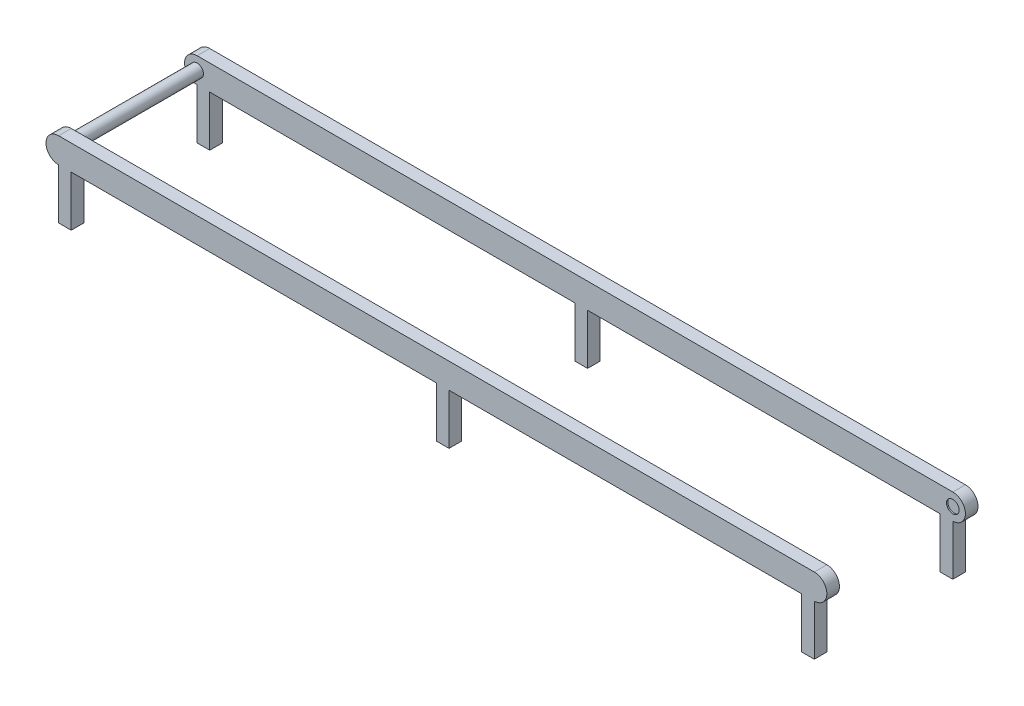
ISO-10303-21;
HEADER;
FILE_DESCRIPTION(('STEP AP214'),'2;1');
FILE_NAME('part.step','',(''),(''),'','','');
FILE_SCHEMA(('AUTOMOTIVE_DESIGN { 1 0 10303 214 1 1 1 1 }'));
ENDSEC;
DATA;
#1=APPLICATION_CONTEXT('core data for automotive mechanical design processes');
#2=APPLICATION_PROTOCOL_DEFINITION('international standard','automotive_design',2000,#1);
#3=PRODUCT_CONTEXT('',#1,'mechanical');
#4=PRODUCT('Part','Part','',(#3));
#5=PRODUCT_RELATED_PRODUCT_CATEGORY('part','',(#4));
#6=PRODUCT_DEFINITION_FORMATION('','',#4);
#7=PRODUCT_DEFINITION_CONTEXT('part definition',#1,'design');
#8=PRODUCT_DEFINITION('design','',#6,#7);
#9=PRODUCT_DEFINITION_SHAPE('','',#8);
#10=(LENGTH_UNIT() NAMED_UNIT(*) SI_UNIT(.MILLI.,.METRE.));
#11=(NAMED_UNIT(*) PLANE_ANGLE_UNIT() SI_UNIT($,.RADIAN.));
#12=(NAMED_UNIT(*) SI_UNIT($,.STERADIAN.) SOLID_ANGLE_UNIT());
#13=UNCERTAINTY_MEASURE_WITH_UNIT(LENGTH_MEASURE(1.E-05),#10,'distance_accuracy_value','');
#14=(GEOMETRIC_REPRESENTATION_CONTEXT(3) GLOBAL_UNCERTAINTY_ASSIGNED_CONTEXT((#13)) GLOBAL_UNIT_ASSIGNED_CONTEXT((#10,
#11,#12)) REPRESENTATION_CONTEXT('',''));
#15=CARTESIAN_POINT('',(0.,0.,0.));
#16=DIRECTION('',(0.,0.,1.));
#17=DIRECTION('',(1.,0.,0.));
#18=AXIS2_PLACEMENT_3D('',#15,#16,#17);
#19=CARTESIAN_POINT('',(-300.,-10.0000000000001,10.));
#20=DIRECTION('',(0.,1.,0.));
#21=DIRECTION('',(0.,0.,1.));
#22=AXIS2_PLACEMENT_3D('',#19,#20,#21);
#23=PLANE('',#22);
#24=DIRECTION('',(0.,0.,1.));
#25=VECTOR('',#24,1.);
#26=CARTESIAN_POINT('',(10.,-10.0000000000001,0.));
#27=LINE('',#26,#25);
#28=CARTESIAN_POINT('',(10.,-10.0000000000001,0.));
#29=VERTEX_POINT('',#28);
#30=CARTESIAN_POINT('',(10.,-10.0000000000001,10.));
#31=VERTEX_POINT('',#30);
#32=EDGE_CURVE('E233',#29,#31,#27,.T.);
#33=ORIENTED_EDGE('',*,*,#32,.F.);
#34=DIRECTION('',(1.,0.,0.));
#35=VECTOR('',#34,1.);
#36=CARTESIAN_POINT('',(-300.,-10.0000000000001,0.));
#37=LINE('',#36,#35);
#38=CARTESIAN_POINT('',(290.,-10.0000000000001,0.));
#39=VERTEX_POINT('',#38);
#40=EDGE_CURVE('E219',#29,#39,#37,.T.);
#41=ORIENTED_EDGE('',*,*,#40,.T.);
#42=DIRECTION('',(0.,0.,1.));
#43=VECTOR('',#42,1.);
#44=CARTESIAN_POINT('',(290.,-10.0000000000001,0.));
#45=LINE('',#44,#43);
#46=CARTESIAN_POINT('',(290.,-10.0000000000001,10.));
#47=VERTEX_POINT('',#46);
#48=EDGE_CURVE('E322',#39,#47,#45,.T.);
#49=ORIENTED_EDGE('',*,*,#48,.T.);
#50=DIRECTION('',(1.,0.,0.));
#51=VECTOR('',#50,1.);
#52=CARTESIAN_POINT('',(-300.,-10.0000000000001,10.));
#53=LINE('',#52,#51);
#54=EDGE_CURVE('E48',#31,#47,#53,.T.);
#55=ORIENTED_EDGE('',*,*,#54,.F.);
#56=EDGE_LOOP('',(#33,#41,#49,#55));
#57=FACE_BOUND('',#56,.T.);
#58=ADVANCED_FACE('F33',(#57),#23,.F.);
#59=CARTESIAN_POINT('',(-300.,-10.0000000000001,120.));
#60=DIRECTION('',(0.,1.,0.));
#61=DIRECTION('',(-1.,0.,0.));
#62=AXIS2_PLACEMENT_3D('',#59,#60,#61);
#63=PLANE('',#62);
#64=DIRECTION('',(0.,0.,1.));
#65=VECTOR('',#64,1.);
#66=CARTESIAN_POINT('',(10.,-10.0000000000001,110.));
#67=LINE('',#66,#65);
#68=CARTESIAN_POINT('',(10.,-10.0000000000001,110.));
#69=VERTEX_POINT('',#68);
#70=CARTESIAN_POINT('',(10.,-10.0000000000001,120.));
#71=VERTEX_POINT('',#70);
#72=EDGE_CURVE('E272',#69,#71,#67,.T.);
#73=ORIENTED_EDGE('',*,*,#72,.F.);
#74=DIRECTION('',(1.,0.,0.));
#75=VECTOR('',#74,1.);
#76=CARTESIAN_POINT('',(-300.,-10.0000000000001,110.));
#77=LINE('',#76,#75);
#78=CARTESIAN_POINT('',(290.,-10.0000000000001,110.));
#79=VERTEX_POINT('',#78);
#80=EDGE_CURVE('E402',#69,#79,#77,.T.);
#81=ORIENTED_EDGE('',*,*,#80,.T.);
#82=DIRECTION('',(0.,0.,1.));
#83=VECTOR('',#82,1.);
#84=CARTESIAN_POINT('',(290.,-10.0000000000001,110.));
#85=LINE('',#84,#83);
#86=CARTESIAN_POINT('',(290.,-10.0000000000001,120.));
#87=VERTEX_POINT('',#86);
#88=EDGE_CURVE('E299',#79,#87,#85,.T.);
#89=ORIENTED_EDGE('',*,*,#88,.T.);
#90=DIRECTION('',(1.,0.,0.));
#91=VECTOR('',#90,1.);
#92=CARTESIAN_POINT('',(-300.,-10.0000000000001,120.));
#93=LINE('',#92,#91);
#94=EDGE_CURVE('E391',#71,#87,#93,.T.);
#95=ORIENTED_EDGE('',*,*,#94,.F.);
#96=EDGE_LOOP('',(#73,#81,#89,#95));
#97=FACE_BOUND('',#96,.T.);
#98=ADVANCED_FACE('F486',(#97),#63,.F.);
#99=CARTESIAN_POINT('',(-290.,-10.0000000000001,110.));
#100=VERTEX_POINT('',#99);
#101=CARTESIAN_POINT('',(0.,-10.0000000000001,110.));
#102=VERTEX_POINT('',#101);
#103=EDGE_CURVE('E387',#100,#102,#77,.T.);
#104=ORIENTED_EDGE('',*,*,#103,.T.);
#105=DIRECTION('',(0.,0.,1.));
#106=VECTOR('',#105,1.);
#107=CARTESIAN_POINT('',(0.,-10.0000000000001,110.));
#108=LINE('',#107,#106);
#109=CARTESIAN_POINT('',(0.,-10.0000000000001,120.));
#110=VERTEX_POINT('',#109);
#111=EDGE_CURVE('E275',#102,#110,#108,.T.);
#112=ORIENTED_EDGE('',*,*,#111,.T.);
#113=CARTESIAN_POINT('',(-290.,-10.0000000000001,120.));
#114=VERTEX_POINT('',#113);
#115=EDGE_CURVE('E392',#114,#110,#93,.T.);
#116=ORIENTED_EDGE('',*,*,#115,.F.);
#117=DIRECTION('',(0.,0.,1.));
#118=VECTOR('',#117,1.);
#119=CARTESIAN_POINT('',(-290.,-10.0000000000001,110.));
#120=LINE('',#119,#118);
#121=EDGE_CURVE('E348',#100,#114,#120,.T.);
#122=ORIENTED_EDGE('',*,*,#121,.F.);
#123=EDGE_LOOP('',(#104,#112,#116,#122));
#124=FACE_BOUND('',#123,.T.);
#125=ADVANCED_FACE('F491',(#124),#63,.F.);
#126=CARTESIAN_POINT('',(-300.,0.,10.));
#127=DIRECTION('',(0.,0.,-1.));
#128=DIRECTION('',(-1.,0.,0.));
#129=AXIS2_PLACEMENT_3D('',#126,#127,#128);
#130=CYLINDRICAL_SURFACE('',#129,10.0000000000001);
#131=CARTESIAN_POINT('',(-300.,0.,0.));
#132=DIRECTION('',(0.,0.,1.));
#133=DIRECTION('',(1.,0.,0.));
#134=AXIS2_PLACEMENT_3D('',#131,#132,#133);
#135=CIRCLE('',#134,10.0000000000001);
#136=CARTESIAN_POINT('',(-300.,10.0000000000001,0.));
#137=VERTEX_POINT('',#136);
#138=CARTESIAN_POINT('',(-300.,-10.0000000000001,0.));
#139=VERTEX_POINT('',#138);
#140=EDGE_CURVE('E230',#137,#139,#135,.T.);
#141=ORIENTED_EDGE('',*,*,#140,.T.);
#142=DIRECTION('',(0.,0.,-1.));
#143=VECTOR('',#142,1.);
#144=CARTESIAN_POINT('',(-300.,-10.0000000000001,10.));
#145=LINE('',#144,#143);
#146=CARTESIAN_POINT('',(-300.,-10.0000000000001,10.));
#147=VERTEX_POINT('',#146);
#148=EDGE_CURVE('E11',#147,#139,#145,.T.);
#149=ORIENTED_EDGE('',*,*,#148,.F.);
#150=CARTESIAN_POINT('',(-300.,0.,10.));
#151=DIRECTION('',(0.,0.,1.));
#152=DIRECTION('',(1.,0.,0.));
#153=AXIS2_PLACEMENT_3D('',#150,#151,#152);
#154=CIRCLE('',#153,10.0000000000001);
#155=CARTESIAN_POINT('',(-300.,10.0000000000001,10.));
#156=VERTEX_POINT('',#155);
#157=EDGE_CURVE('E427',#156,#147,#154,.T.);
#158=ORIENTED_EDGE('',*,*,#157,.F.);
#159=DIRECTION('',(0.,0.,-1.));
#160=VECTOR('',#159,1.);
#161=CARTESIAN_POINT('',(-300.,10.0000000000001,10.));
#162=LINE('',#161,#160);
#163=EDGE_CURVE('E436',#156,#137,#162,.T.);
#164=ORIENTED_EDGE('',*,*,#163,.T.);
#165=EDGE_LOOP('',(#141,#149,#158,#164));
#166=FACE_BOUND('',#165,.T.);
#167=ADVANCED_FACE('F35',(#166),#130,.T.);
#168=CARTESIAN_POINT('',(-290.,-10.0000000000001,0.));
#169=VERTEX_POINT('',#168);
#170=CARTESIAN_POINT('',(0.,-10.0000000000001,0.));
#171=VERTEX_POINT('',#170);
#172=EDGE_CURVE('E229',#169,#171,#37,.T.);
#173=ORIENTED_EDGE('',*,*,#172,.T.);
#174=DIRECTION('',(0.,0.,1.));
#175=VECTOR('',#174,1.);
#176=CARTESIAN_POINT('',(0.,-10.0000000000001,0.));
#177=LINE('',#176,#175);
#178=CARTESIAN_POINT('',(0.,-10.0000000000001,10.));
#179=VERTEX_POINT('',#178);
#180=EDGE_CURVE('E56',#171,#179,#177,.T.);
#181=ORIENTED_EDGE('',*,*,#180,.T.);
#182=CARTESIAN_POINT('',(-290.,-10.0000000000001,10.));
#183=VERTEX_POINT('',#182);
#184=EDGE_CURVE('E430',#183,#179,#53,.T.);
#185=ORIENTED_EDGE('',*,*,#184,.F.);
#186=DIRECTION('',(0.,0.,-1.));
#187=VECTOR('',#186,1.);
#188=CARTESIAN_POINT('',(-290.,-10.0000000000001,10.));
#189=LINE('',#188,#187);
#190=EDGE_CURVE('E345',#183,#169,#189,.T.);
#191=ORIENTED_EDGE('',*,*,#190,.T.);
#192=EDGE_LOOP('',(#173,#181,#185,#191));
#193=FACE_BOUND('',#192,.T.);
#194=ADVANCED_FACE('F487',(#193),#23,.F.);
#195=CARTESIAN_POINT('',(300.,0.,10.));
#196=DIRECTION('',(0.,0.,-1.));
#197=DIRECTION('',(-1.,0.,0.));
#198=AXIS2_PLACEMENT_3D('',#195,#196,#197);
#199=CYLINDRICAL_SURFACE('',#198,10.0000000000001);
#200=CARTESIAN_POINT('',(300.,0.,0.));
#201=DIRECTION('',(0.,0.,1.));
#202=DIRECTION('',(1.,0.,0.));
#203=AXIS2_PLACEMENT_3D('',#200,#201,#202);
#204=CIRCLE('',#203,10.0000000000001);
#205=CARTESIAN_POINT('',(300.,-10.0000000000001,0.));
#206=VERTEX_POINT('',#205);
#207=CARTESIAN_POINT('',(300.,10.0000000000001,0.));
#208=VERTEX_POINT('',#207);
#209=EDGE_CURVE('E438',#206,#208,#204,.T.);
#210=ORIENTED_EDGE('',*,*,#209,.T.);
#211=DIRECTION('',(0.,0.,-1.));
#212=VECTOR('',#211,1.);
#213=CARTESIAN_POINT('',(300.,10.0000000000001,10.));
#214=LINE('',#213,#212);
#215=CARTESIAN_POINT('',(300.,10.0000000000001,10.));
#216=VERTEX_POINT('',#215);
#217=EDGE_CURVE('E443',#216,#208,#214,.T.);
#218=ORIENTED_EDGE('',*,*,#217,.F.);
#219=CARTESIAN_POINT('',(300.,0.,10.));
#220=DIRECTION('',(0.,0.,1.));
#221=DIRECTION('',(1.,0.,0.));
#222=AXIS2_PLACEMENT_3D('',#219,#220,#221);
#223=CIRCLE('',#222,10.0000000000001);
#224=CARTESIAN_POINT('',(300.,-10.0000000000001,10.));
#225=VERTEX_POINT('',#224);
#226=EDGE_CURVE('E432',#225,#216,#223,.T.);
#227=ORIENTED_EDGE('',*,*,#226,.F.);
#228=DIRECTION('',(0.,0.,-1.));
#229=VECTOR('',#228,1.);
#230=CARTESIAN_POINT('',(300.,-10.0000000000001,10.));
#231=LINE('',#230,#229);
#232=EDGE_CURVE('E41',#225,#206,#231,.T.);
#233=ORIENTED_EDGE('',*,*,#232,.T.);
#234=EDGE_LOOP('',(#210,#218,#227,#233));
#235=FACE_BOUND('',#234,.T.);
#236=ADVANCED_FACE('F448',(#235),#199,.T.);
#237=CARTESIAN_POINT('',(-300.,10.0000000000001,10.));
#238=DIRECTION('',(0.,-1.,0.));
#239=DIRECTION('',(0.,0.,-1.));
#240=AXIS2_PLACEMENT_3D('',#237,#238,#239);
#241=PLANE('',#240);
#242=DIRECTION('',(-1.,0.,0.));
#243=VECTOR('',#242,1.);
#244=CARTESIAN_POINT('',(-300.,10.0000000000001,0.));
#245=LINE('',#244,#243);
#246=EDGE_CURVE('E429',#208,#137,#245,.T.);
#247=ORIENTED_EDGE('',*,*,#246,.T.);
#248=ORIENTED_EDGE('',*,*,#163,.F.);
#249=DIRECTION('',(-1.,0.,0.));
#250=VECTOR('',#249,1.);
#251=CARTESIAN_POINT('',(-300.,10.0000000000001,10.));
#252=LINE('',#251,#250);
#253=EDGE_CURVE('E434',#216,#156,#252,.T.);
#254=ORIENTED_EDGE('',*,*,#253,.F.);
#255=ORIENTED_EDGE('',*,*,#217,.T.);
#256=EDGE_LOOP('',(#247,#248,#254,#255));
#257=FACE_BOUND('',#256,.T.);
#258=ADVANCED_FACE('F458',(#257),#241,.F.);
#259=CARTESIAN_POINT('',(-300.,0.,10.));
#260=DIRECTION('',(0.,0.,1.));
#261=DIRECTION('',(1.,0.,0.));
#262=AXIS2_PLACEMENT_3D('',#259,#260,#261);
#263=PLANE('',#262);
#264=CARTESIAN_POINT('',(300.,0.,10.));
#265=DIRECTION('',(0.,0.,1.));
#266=DIRECTION('',(1.,0.,0.));
#267=AXIS2_PLACEMENT_3D('',#264,#265,#266);
#268=CIRCLE('',#267,4.99999999999999);
#269=CARTESIAN_POINT('',(305.,0.,10.));
#270=VERTEX_POINT('',#269);
#271=EDGE_CURVE('E415',#270,#270,#268,.T.);
#272=ORIENTED_EDGE('',*,*,#271,.F.);
#273=EDGE_LOOP('',(#272));
#274=FACE_BOUND('',#273,.T.);
#275=CARTESIAN_POINT('',(-300.,0.,10.));
#276=DIRECTION('',(0.,0.,1.));
#277=DIRECTION('',(1.,0.,0.));
#278=AXIS2_PLACEMENT_3D('',#275,#276,#277);
#279=CIRCLE('',#278,4.99999999999999);
#280=CARTESIAN_POINT('',(-295.,0.,10.));
#281=VERTEX_POINT('',#280);
#282=EDGE_CURVE('E419',#281,#281,#279,.T.);
#283=ORIENTED_EDGE('',*,*,#282,.F.);
#284=EDGE_LOOP('',(#283));
#285=FACE_BOUND('',#284,.T.);
#286=ORIENTED_EDGE('',*,*,#157,.T.);
#287=DIRECTION('',(0.,1.,0.));
#288=VECTOR('',#287,1.);
#289=CARTESIAN_POINT('',(-300.,-50.0000000000001,10.));
#290=LINE('',#289,#288);
#291=CARTESIAN_POINT('',(-300.,-50.0000000000001,10.));
#292=VERTEX_POINT('',#291);
#293=EDGE_CURVE('E338',#292,#147,#290,.T.);
#294=ORIENTED_EDGE('',*,*,#293,.F.);
#295=DIRECTION('',(1.,0.,0.));
#296=VECTOR('',#295,1.);
#297=CARTESIAN_POINT('',(-300.,-50.0000000000001,10.));
#298=LINE('',#297,#296);
#299=CARTESIAN_POINT('',(-290.,-50.0000000000001,10.));
#300=VERTEX_POINT('',#299);
#301=EDGE_CURVE('E351',#292,#300,#298,.T.);
#302=ORIENTED_EDGE('',*,*,#301,.T.);
#303=DIRECTION('',(0.,1.,0.));
#304=VECTOR('',#303,1.);
#305=CARTESIAN_POINT('',(-290.,-50.0000000000001,10.));
#306=LINE('',#305,#304);
#307=EDGE_CURVE('E335',#300,#183,#306,.T.);
#308=ORIENTED_EDGE('',*,*,#307,.T.);
#309=ORIENTED_EDGE('',*,*,#184,.T.);
#310=DIRECTION('',(0.,1.,0.));
#311=VECTOR('',#310,1.);
#312=CARTESIAN_POINT('',(0.,-50.0000000000001,10.));
#313=LINE('',#312,#311);
#314=CARTESIAN_POINT('',(0.,-50.0000000000001,10.));
#315=VERTEX_POINT('',#314);
#316=EDGE_CURVE('E246',#315,#179,#313,.T.);
#317=ORIENTED_EDGE('',*,*,#316,.F.);
#318=DIRECTION('',(1.,0.,0.));
#319=VECTOR('',#318,1.);
#320=CARTESIAN_POINT('',(0.,-50.0000000000001,10.));
#321=LINE('',#320,#319);
#322=CARTESIAN_POINT('',(9.99999999999999,-50.0000000000001,10.));
#323=VERTEX_POINT('',#322);
#324=EDGE_CURVE('E251',#315,#323,#321,.T.);
#325=ORIENTED_EDGE('',*,*,#324,.T.);
#326=DIRECTION('',(0.,1.,0.));
#327=VECTOR('',#326,1.);
#328=CARTESIAN_POINT('',(9.99999999999999,-50.0000000000001,10.));
#329=LINE('',#328,#327);
#330=EDGE_CURVE('E240',#323,#31,#329,.T.);
#331=ORIENTED_EDGE('',*,*,#330,.T.);
#332=ORIENTED_EDGE('',*,*,#54,.T.);
#333=DIRECTION('',(0.,1.,0.));
#334=VECTOR('',#333,1.);
#335=CARTESIAN_POINT('',(290.,-50.0000000000001,10.));
#336=LINE('',#335,#334);
#337=CARTESIAN_POINT('',(290.,-50.0000000000001,10.));
#338=VERTEX_POINT('',#337);
#339=EDGE_CURVE('E302',#338,#47,#336,.T.);
#340=ORIENTED_EDGE('',*,*,#339,.F.);
#341=DIRECTION('',(-1.,0.,0.));
#342=VECTOR('',#341,1.);
#343=CARTESIAN_POINT('',(300.,-50.0000000000001,10.));
#344=LINE('',#343,#342);
#345=CARTESIAN_POINT('',(300.,-50.0000000000001,10.));
#346=VERTEX_POINT('',#345);
#347=EDGE_CURVE('E325',#346,#338,#344,.T.);
#348=ORIENTED_EDGE('',*,*,#347,.F.);
#349=DIRECTION('',(0.,1.,0.));
#350=VECTOR('',#349,1.);
#351=CARTESIAN_POINT('',(300.,-50.0000000000001,10.));
#352=LINE('',#351,#350);
#353=EDGE_CURVE('E318',#346,#225,#352,.T.);
#354=ORIENTED_EDGE('',*,*,#353,.T.);
#355=ORIENTED_EDGE('',*,*,#226,.T.);
#356=ORIENTED_EDGE('',*,*,#253,.T.);
#357=EDGE_LOOP('',(#286,#294,#302,#308,#309,#317,#325,#331,#332,#340,#348,#354,#355,#356));
#358=FACE_BOUND('',#357,.T.);
#359=ADVANCED_FACE('F464',(#274,#285,#358),#263,.T.);
#360=CARTESIAN_POINT('',(-300.,0.,0.));
#361=DIRECTION('',(0.,0.,1.));
#362=DIRECTION('',(1.,0.,0.));
#363=AXIS2_PLACEMENT_3D('',#360,#361,#362);
#364=PLANE('',#363);
#365=ORIENTED_EDGE('',*,*,#140,.F.);
#366=ORIENTED_EDGE('',*,*,#246,.F.);
#367=ORIENTED_EDGE('',*,*,#209,.F.);
#368=DIRECTION('',(0.,1.,0.));
#369=VECTOR('',#368,1.);
#370=CARTESIAN_POINT('',(300.,-50.0000000000001,0.));
#371=LINE('',#370,#369);
#372=CARTESIAN_POINT('',(300.,-50.0000000000001,0.));
#373=VERTEX_POINT('',#372);
#374=EDGE_CURVE('E315',#373,#206,#371,.T.);
#375=ORIENTED_EDGE('',*,*,#374,.F.);
#376=DIRECTION('',(-1.,0.,0.));
#377=VECTOR('',#376,1.);
#378=CARTESIAN_POINT('',(300.,-50.0000000000001,0.));
#379=LINE('',#378,#377);
#380=CARTESIAN_POINT('',(290.,-50.0000000000001,0.));
#381=VERTEX_POINT('',#380);
#382=EDGE_CURVE('E327',#373,#381,#379,.T.);
#383=ORIENTED_EDGE('',*,*,#382,.T.);
#384=DIRECTION('',(0.,1.,0.));
#385=VECTOR('',#384,1.);
#386=CARTESIAN_POINT('',(290.,-50.0000000000001,0.));
#387=LINE('',#386,#385);
#388=EDGE_CURVE('E227',#381,#39,#387,.T.);
#389=ORIENTED_EDGE('',*,*,#388,.T.);
#390=ORIENTED_EDGE('',*,*,#40,.F.);
#391=DIRECTION('',(0.,1.,0.));
#392=VECTOR('',#391,1.);
#393=CARTESIAN_POINT('',(9.99999999999999,-50.0000000000001,0.));
#394=LINE('',#393,#392);
#395=CARTESIAN_POINT('',(9.99999999999999,-50.0000000000001,0.));
#396=VERTEX_POINT('',#395);
#397=EDGE_CURVE('E224',#396,#29,#394,.T.);
#398=ORIENTED_EDGE('',*,*,#397,.F.);
#399=DIRECTION('',(1.,0.,0.));
#400=VECTOR('',#399,1.);
#401=CARTESIAN_POINT('',(0.,-50.0000000000001,0.));
#402=LINE('',#401,#400);
#403=CARTESIAN_POINT('',(0.,-50.0000000000001,0.));
#404=VERTEX_POINT('',#403);
#405=EDGE_CURVE('E255',#404,#396,#402,.T.);
#406=ORIENTED_EDGE('',*,*,#405,.F.);
#407=DIRECTION('',(0.,1.,0.));
#408=VECTOR('',#407,1.);
#409=CARTESIAN_POINT('',(0.,-50.0000000000001,0.));
#410=LINE('',#409,#408);
#411=EDGE_CURVE('E241',#404,#171,#410,.T.);
#412=ORIENTED_EDGE('',*,*,#411,.T.);
#413=ORIENTED_EDGE('',*,*,#172,.F.);
#414=DIRECTION('',(0.,1.,0.));
#415=VECTOR('',#414,1.);
#416=CARTESIAN_POINT('',(-290.,-50.0000000000001,0.));
#417=LINE('',#416,#415);
#418=CARTESIAN_POINT('',(-290.,-50.0000000000001,0.));
#419=VERTEX_POINT('',#418);
#420=EDGE_CURVE('E324',#419,#169,#417,.T.);
#421=ORIENTED_EDGE('',*,*,#420,.F.);
#422=DIRECTION('',(1.,0.,0.));
#423=VECTOR('',#422,1.);
#424=CARTESIAN_POINT('',(-300.,-50.0000000000001,0.));
#425=LINE('',#424,#423);
#426=CARTESIAN_POINT('',(-300.,-50.0000000000001,0.));
#427=VERTEX_POINT('',#426);
#428=EDGE_CURVE('E349',#427,#419,#425,.T.);
#429=ORIENTED_EDGE('',*,*,#428,.F.);
#430=DIRECTION('',(0.,1.,0.));
#431=VECTOR('',#430,1.);
#432=CARTESIAN_POINT('',(-300.,-50.0000000000001,0.));
#433=LINE('',#432,#431);
#434=EDGE_CURVE('E341',#427,#139,#433,.T.);
#435=ORIENTED_EDGE('',*,*,#434,.T.);
#436=EDGE_LOOP('',(#365,#366,#367,#375,#383,#389,#390,#398,#406,#412,#413,#421,#429,#435));
#437=FACE_BOUND('',#436,.T.);
#438=ADVANCED_FACE('F221',(#437),#364,.F.);
#439=CARTESIAN_POINT('',(-300.,0.,110.));
#440=DIRECTION('',(0.,0.,-1.));
#441=DIRECTION('',(-1.,0.,0.));
#442=AXIS2_PLACEMENT_3D('',#439,#440,#441);
#443=CYLINDRICAL_SURFACE('',#442,4.99999999999999);
#444=CARTESIAN_POINT('',(-300.,0.,110.));
#445=DIRECTION('',(0.,0.,1.));
#446=DIRECTION('',(1.,0.,0.));
#447=AXIS2_PLACEMENT_3D('',#444,#445,#446);
#448=CIRCLE('',#447,4.99999999999999);
#449=CARTESIAN_POINT('',(-295.,0.,110.));
#450=VERTEX_POINT('',#449);
#451=EDGE_CURVE('E422',#450,#450,#448,.T.);
#452=ORIENTED_EDGE('',*,*,#451,.F.);
#453=EDGE_LOOP('',(#452));
#454=FACE_BOUND('',#453,.T.);
#455=ORIENTED_EDGE('',*,*,#282,.T.);
#456=EDGE_LOOP('',(#455));
#457=FACE_BOUND('',#456,.T.);
#458=ADVANCED_FACE('F604',(#454,#457),#443,.T.);
#459=CARTESIAN_POINT('',(300.,0.,9.));
#460=DIRECTION('',(0.,0.,1.));
#461=DIRECTION('',(1.,0.,0.));
#462=AXIS2_PLACEMENT_3D('',#459,#460,#461);
#463=CYLINDRICAL_SURFACE('',#462,4.99999999999999);
#464=CARTESIAN_POINT('',(300.,0.,9.));
#465=DIRECTION('',(0.,0.,1.));
#466=DIRECTION('',(1.,0.,0.));
#467=AXIS2_PLACEMENT_3D('',#464,#465,#466);
#468=CIRCLE('',#467,4.99999999999999);
#469=CARTESIAN_POINT('',(305.,0.,9.));
#470=VERTEX_POINT('',#469);
#471=EDGE_CURVE('E416',#470,#470,#468,.T.);
#472=ORIENTED_EDGE('',*,*,#471,.F.);
#473=EDGE_LOOP('',(#472));
#474=FACE_BOUND('',#473,.T.);
#475=ORIENTED_EDGE('',*,*,#271,.T.);
#476=EDGE_LOOP('',(#475));
#477=FACE_BOUND('',#476,.T.);
#478=ADVANCED_FACE('F600',(#474,#477),#463,.F.);
#479=CARTESIAN_POINT('',(300.,0.,9.));
#480=DIRECTION('',(0.,0.,1.));
#481=DIRECTION('',(1.,0.,0.));
#482=AXIS2_PLACEMENT_3D('',#479,#480,#481);
#483=PLANE('',#482);
#484=ORIENTED_EDGE('',*,*,#471,.T.);
#485=EDGE_LOOP('',(#484));
#486=FACE_BOUND('',#485,.T.);
#487=ADVANCED_FACE('F597',(#486),#483,.T.);
#488=CARTESIAN_POINT('',(300.,0.,120.));
#489=DIRECTION('',(0.,0.,-1.));
#490=DIRECTION('',(-1.,0.,0.));
#491=AXIS2_PLACEMENT_3D('',#488,#489,#490);
#492=CYLINDRICAL_SURFACE('',#491,10.0000000000001);
#493=CARTESIAN_POINT('',(300.,0.,110.));
#494=DIRECTION('',(0.,0.,1.));
#495=DIRECTION('',(1.,0.,0.));
#496=AXIS2_PLACEMENT_3D('',#493,#494,#495);
#497=CIRCLE('',#496,10.0000000000001);
#498=CARTESIAN_POINT('',(300.,-10.0000000000001,110.));
#499=VERTEX_POINT('',#498);
#500=CARTESIAN_POINT('',(300.,10.0000000000001,110.));
#501=VERTEX_POINT('',#500);
#502=EDGE_CURVE('E374',#499,#501,#497,.T.);
#503=ORIENTED_EDGE('',*,*,#502,.T.);
#504=DIRECTION('',(0.,0.,-1.));
#505=VECTOR('',#504,1.);
#506=CARTESIAN_POINT('',(300.,10.0000000000001,120.));
#507=LINE('',#506,#505);
#508=CARTESIAN_POINT('',(300.,10.0000000000001,120.));
#509=VERTEX_POINT('',#508);
#510=EDGE_CURVE('E412',#509,#501,#507,.T.);
#511=ORIENTED_EDGE('',*,*,#510,.F.);
#512=CARTESIAN_POINT('',(300.,0.,120.));
#513=DIRECTION('',(0.,0.,1.));
#514=DIRECTION('',(1.,0.,0.));
#515=AXIS2_PLACEMENT_3D('',#512,#513,#514);
#516=CIRCLE('',#515,10.0000000000001);
#517=CARTESIAN_POINT('',(300.,-10.0000000000001,120.));
#518=VERTEX_POINT('',#517);
#519=EDGE_CURVE('E383',#518,#509,#516,.T.);
#520=ORIENTED_EDGE('',*,*,#519,.F.);
#521=DIRECTION('',(0.,0.,-1.));
#522=VECTOR('',#521,1.);
#523=CARTESIAN_POINT('',(300.,-10.0000000000001,120.));
#524=LINE('',#523,#522);
#525=EDGE_CURVE('E395',#518,#499,#524,.T.);
#526=ORIENTED_EDGE('',*,*,#525,.T.);
#527=EDGE_LOOP('',(#503,#511,#520,#526));
#528=FACE_BOUND('',#527,.T.);
#529=ADVANCED_FACE('F556',(#528),#492,.T.);
#530=CARTESIAN_POINT('',(300.,10.0000000000001,120.));
#531=DIRECTION('',(0.,-1.,0.));
#532=DIRECTION('',(0.,0.,-1.));
#533=AXIS2_PLACEMENT_3D('',#530,#531,#532);
#534=PLANE('',#533);
#535=DIRECTION('',(-1.,0.,0.));
#536=VECTOR('',#535,1.);
#537=CARTESIAN_POINT('',(300.,10.0000000000001,110.));
#538=LINE('',#537,#536);
#539=CARTESIAN_POINT('',(-300.,10.,110.));
#540=VERTEX_POINT('',#539);
#541=EDGE_CURVE('E398',#501,#540,#538,.T.);
#542=ORIENTED_EDGE('',*,*,#541,.T.);
#543=DIRECTION('',(0.,0.,-1.));
#544=VECTOR('',#543,1.);
#545=CARTESIAN_POINT('',(-300.,10.,120.));
#546=LINE('',#545,#544);
#547=CARTESIAN_POINT('',(-300.,10.,120.));
#548=VERTEX_POINT('',#547);
#549=EDGE_CURVE('E409',#548,#540,#546,.T.);
#550=ORIENTED_EDGE('',*,*,#549,.F.);
#551=DIRECTION('',(-1.,0.,0.));
#552=VECTOR('',#551,1.);
#553=CARTESIAN_POINT('',(300.,10.0000000000001,120.));
#554=LINE('',#553,#552);
#555=EDGE_CURVE('E386',#509,#548,#554,.T.);
#556=ORIENTED_EDGE('',*,*,#555,.F.);
#557=ORIENTED_EDGE('',*,*,#510,.T.);
#558=EDGE_LOOP('',(#542,#550,#556,#557));
#559=FACE_BOUND('',#558,.T.);
#560=ADVANCED_FACE('F558',(#559),#534,.F.);
#561=CARTESIAN_POINT('',(-300.,0.,120.));
#562=DIRECTION('',(0.,0.,-1.));
#563=DIRECTION('',(-1.,0.,0.));
#564=AXIS2_PLACEMENT_3D('',#561,#562,#563);
#565=CYLINDRICAL_SURFACE('',#564,10.0000000000001);
#566=CARTESIAN_POINT('',(-300.,0.,110.));
#567=DIRECTION('',(0.,0.,1.));
#568=DIRECTION('',(1.,0.,0.));
#569=AXIS2_PLACEMENT_3D('',#566,#567,#568);
#570=CIRCLE('',#569,10.0000000000001);
#571=CARTESIAN_POINT('',(-300.,-10.0000000000001,110.));
#572=VERTEX_POINT('',#571);
#573=EDGE_CURVE('E400',#540,#572,#570,.T.);
#574=ORIENTED_EDGE('',*,*,#573,.T.);
#575=DIRECTION('',(0.,0.,-1.));
#576=VECTOR('',#575,1.);
#577=CARTESIAN_POINT('',(-300.,-10.0000000000001,120.));
#578=LINE('',#577,#576);
#579=CARTESIAN_POINT('',(-300.,-10.0000000000001,120.));
#580=VERTEX_POINT('',#579);
#581=EDGE_CURVE('E406',#580,#572,#578,.T.);
#582=ORIENTED_EDGE('',*,*,#581,.F.);
#583=CARTESIAN_POINT('',(-300.,0.,120.));
#584=DIRECTION('',(0.,0.,1.));
#585=DIRECTION('',(1.,0.,0.));
#586=AXIS2_PLACEMENT_3D('',#583,#584,#585);
#587=CIRCLE('',#586,10.0000000000001);
#588=EDGE_CURVE('E389',#548,#580,#587,.T.);
#589=ORIENTED_EDGE('',*,*,#588,.F.);
#590=ORIENTED_EDGE('',*,*,#549,.T.);
#591=EDGE_LOOP('',(#574,#582,#589,#590));
#592=FACE_BOUND('',#591,.T.);
#593=ADVANCED_FACE('F563',(#592),#565,.T.);
#594=CARTESIAN_POINT('',(300.,0.,120.));
#595=DIRECTION('',(0.,0.,1.));
#596=DIRECTION('',(1.,0.,0.));
#597=AXIS2_PLACEMENT_3D('',#594,#595,#596);
#598=PLANE('',#597);
#599=ORIENTED_EDGE('',*,*,#519,.T.);
#600=ORIENTED_EDGE('',*,*,#555,.T.);
#601=ORIENTED_EDGE('',*,*,#588,.T.);
#602=DIRECTION('',(0.,1.,0.));
#603=VECTOR('',#602,1.);
#604=CARTESIAN_POINT('',(-300.,-50.0000000000001,120.));
#605=LINE('',#604,#603);
#606=CARTESIAN_POINT('',(-300.,-50.0000000000001,120.));
#607=VERTEX_POINT('',#606);
#608=EDGE_CURVE('E371',#607,#580,#605,.T.);
#609=ORIENTED_EDGE('',*,*,#608,.F.);
#610=DIRECTION('',(1.,0.,0.));
#611=VECTOR('',#610,1.);
#612=CARTESIAN_POINT('',(-300.,-50.0000000000001,120.));
#613=LINE('',#612,#611);
#614=CARTESIAN_POINT('',(-290.,-50.0000000000001,120.));
#615=VERTEX_POINT('',#614);
#616=EDGE_CURVE('E358',#607,#615,#613,.T.);
#617=ORIENTED_EDGE('',*,*,#616,.T.);
#618=DIRECTION('',(0.,1.,0.));
#619=VECTOR('',#618,1.);
#620=CARTESIAN_POINT('',(-290.,-50.0000000000001,120.));
#621=LINE('',#620,#619);
#622=EDGE_CURVE('E368',#615,#114,#621,.T.);
#623=ORIENTED_EDGE('',*,*,#622,.T.);
#624=ORIENTED_EDGE('',*,*,#115,.T.);
#625=DIRECTION('',(0.,1.,0.));
#626=VECTOR('',#625,1.);
#627=CARTESIAN_POINT('',(0.,-50.0000000000001,120.));
#628=LINE('',#627,#626);
#629=CARTESIAN_POINT('',(0.,-50.0000000000001,120.));
#630=VERTEX_POINT('',#629);
#631=EDGE_CURVE('E236',#630,#110,#628,.T.);
#632=ORIENTED_EDGE('',*,*,#631,.F.);
#633=DIRECTION('',(-1.,0.,0.));
#634=VECTOR('',#633,1.);
#635=CARTESIAN_POINT('',(9.99999999999999,-50.0000000000001,120.));
#636=LINE('',#635,#634);
#637=CARTESIAN_POINT('',(9.99999999999999,-50.0000000000001,120.));
#638=VERTEX_POINT('',#637);
#639=EDGE_CURVE('E276',#638,#630,#636,.T.);
#640=ORIENTED_EDGE('',*,*,#639,.F.);
#641=DIRECTION('',(0.,1.,0.));
#642=VECTOR('',#641,1.);
#643=CARTESIAN_POINT('',(9.99999999999999,-50.0000000000001,120.));
#644=LINE('',#643,#642);
#645=EDGE_CURVE('E268',#638,#71,#644,.T.);
#646=ORIENTED_EDGE('',*,*,#645,.T.);
#647=ORIENTED_EDGE('',*,*,#94,.T.);
#648=DIRECTION('',(0.,1.,0.));
#649=VECTOR('',#648,1.);
#650=CARTESIAN_POINT('',(290.,-50.0000000000001,120.));
#651=LINE('',#650,#649);
#652=CARTESIAN_POINT('',(290.,-50.0000000000001,120.));
#653=VERTEX_POINT('',#652);
#654=EDGE_CURVE('E278',#653,#87,#651,.T.);
#655=ORIENTED_EDGE('',*,*,#654,.F.);
#656=DIRECTION('',(-1.,0.,0.));
#657=VECTOR('',#656,1.);
#658=CARTESIAN_POINT('',(300.,-50.0000000000001,120.));
#659=LINE('',#658,#657);
#660=CARTESIAN_POINT('',(300.,-50.0000000000001,120.));
#661=VERTEX_POINT('',#660);
#662=EDGE_CURVE('E303',#661,#653,#659,.T.);
#663=ORIENTED_EDGE('',*,*,#662,.F.);
#664=DIRECTION('',(0.,1.,0.));
#665=VECTOR('',#664,1.);
#666=CARTESIAN_POINT('',(300.,-50.0000000000001,120.));
#667=LINE('',#666,#665);
#668=EDGE_CURVE('E295',#661,#518,#667,.T.);
#669=ORIENTED_EDGE('',*,*,#668,.T.);
#670=EDGE_LOOP('',(#599,#600,#601,#609,#617,#623,#624,#632,#640,#646,#647,#655,#663,#669));
#671=FACE_BOUND('',#670,.T.);
#672=ADVANCED_FACE('F547',(#671),#598,.T.);
#673=CARTESIAN_POINT('',(300.,0.,110.));
#674=DIRECTION('',(0.,0.,1.));
#675=DIRECTION('',(1.,0.,0.));
#676=AXIS2_PLACEMENT_3D('',#673,#674,#675);
#677=PLANE('',#676);
#678=ORIENTED_EDGE('',*,*,#451,.T.);
#679=EDGE_LOOP('',(#678));
#680=FACE_BOUND('',#679,.T.);
#681=ORIENTED_EDGE('',*,*,#502,.F.);
#682=DIRECTION('',(0.,1.,0.));
#683=VECTOR('',#682,1.);
#684=CARTESIAN_POINT('',(300.,-50.0000000000001,110.));
#685=LINE('',#684,#683);
#686=CARTESIAN_POINT('',(300.,-50.0000000000001,110.));
#687=VERTEX_POINT('',#686);
#688=EDGE_CURVE('E292',#687,#499,#685,.T.);
#689=ORIENTED_EDGE('',*,*,#688,.F.);
#690=DIRECTION('',(-1.,0.,0.));
#691=VECTOR('',#690,1.);
#692=CARTESIAN_POINT('',(300.,-50.0000000000001,110.));
#693=LINE('',#692,#691);
#694=CARTESIAN_POINT('',(290.,-50.0000000000001,110.));
#695=VERTEX_POINT('',#694);
#696=EDGE_CURVE('E305',#687,#695,#693,.T.);
#697=ORIENTED_EDGE('',*,*,#696,.T.);
#698=DIRECTION('',(0.,1.,0.));
#699=VECTOR('',#698,1.);
#700=CARTESIAN_POINT('',(290.,-50.0000000000001,110.));
#701=LINE('',#700,#699);
#702=EDGE_CURVE('E289',#695,#79,#701,.T.);
#703=ORIENTED_EDGE('',*,*,#702,.T.);
#704=ORIENTED_EDGE('',*,*,#80,.F.);
#705=DIRECTION('',(0.,1.,0.));
#706=VECTOR('',#705,1.);
#707=CARTESIAN_POINT('',(10.,-50.0000000000001,110.));
#708=LINE('',#707,#706);
#709=CARTESIAN_POINT('',(10.,-50.0000000000001,110.));
#710=VERTEX_POINT('',#709);
#711=EDGE_CURVE('E265',#710,#69,#708,.T.);
#712=ORIENTED_EDGE('',*,*,#711,.F.);
#713=DIRECTION('',(-1.,0.,0.));
#714=VECTOR('',#713,1.);
#715=CARTESIAN_POINT('',(10.,-50.0000000000001,110.));
#716=LINE('',#715,#714);
#717=CARTESIAN_POINT('',(0.,-50.0000000000001,110.));
#718=VERTEX_POINT('',#717);
#719=EDGE_CURVE('E280',#710,#718,#716,.T.);
#720=ORIENTED_EDGE('',*,*,#719,.T.);
#721=DIRECTION('',(0.,1.,0.));
#722=VECTOR('',#721,1.);
#723=CARTESIAN_POINT('',(0.,-50.0000000000001,110.));
#724=LINE('',#723,#722);
#725=EDGE_CURVE('E262',#718,#102,#724,.T.);
#726=ORIENTED_EDGE('',*,*,#725,.T.);
#727=ORIENTED_EDGE('',*,*,#103,.F.);
#728=DIRECTION('',(0.,1.,0.));
#729=VECTOR('',#728,1.);
#730=CARTESIAN_POINT('',(-290.,-50.0000000000001,110.));
#731=LINE('',#730,#729);
#732=CARTESIAN_POINT('',(-290.,-50.0000000000001,110.));
#733=VERTEX_POINT('',#732);
#734=EDGE_CURVE('E378',#733,#100,#731,.T.);
#735=ORIENTED_EDGE('',*,*,#734,.F.);
#736=DIRECTION('',(1.,0.,0.));
#737=VECTOR('',#736,1.);
#738=CARTESIAN_POINT('',(-300.,-50.0000000000001,110.));
#739=LINE('',#738,#737);
#740=CARTESIAN_POINT('',(-300.,-50.0000000000001,110.));
#741=VERTEX_POINT('',#740);
#742=EDGE_CURVE('E363',#741,#733,#739,.T.);
#743=ORIENTED_EDGE('',*,*,#742,.F.);
#744=DIRECTION('',(0.,1.,0.));
#745=VECTOR('',#744,1.);
#746=CARTESIAN_POINT('',(-300.,-50.0000000000001,110.));
#747=LINE('',#746,#745);
#748=EDGE_CURVE('E375',#741,#572,#747,.T.);
#749=ORIENTED_EDGE('',*,*,#748,.T.);
#750=ORIENTED_EDGE('',*,*,#573,.F.);
#751=ORIENTED_EDGE('',*,*,#541,.F.);
#752=EDGE_LOOP('',(#681,#689,#697,#703,#704,#712,#720,#726,#727,#735,#743,#749,#750,#751));
#753=FACE_BOUND('',#752,.T.);
#754=ADVANCED_FACE('F550',(#680,#753),#677,.F.);
#755=CARTESIAN_POINT('',(-300.,-50.0000000000001,110.));
#756=DIRECTION('',(-1.,0.,0.));
#757=DIRECTION('',(0.,-1.,0.));
#758=AXIS2_PLACEMENT_3D('',#755,#756,#757);
#759=PLANE('',#758);
#760=ORIENTED_EDGE('',*,*,#581,.T.);
#761=ORIENTED_EDGE('',*,*,#748,.F.);
#762=DIRECTION('',(0.,0.,1.));
#763=VECTOR('',#762,1.);
#764=CARTESIAN_POINT('',(-300.,-50.0000000000001,110.));
#765=LINE('',#764,#763);
#766=EDGE_CURVE('E365',#741,#607,#765,.T.);
#767=ORIENTED_EDGE('',*,*,#766,.T.);
#768=ORIENTED_EDGE('',*,*,#608,.T.);
#769=EDGE_LOOP('',(#760,#761,#767,#768));
#770=FACE_BOUND('',#769,.T.);
#771=ADVANCED_FACE('F571',(#770),#759,.T.);
#772=CARTESIAN_POINT('',(-290.,-50.0000000000001,110.));
#773=DIRECTION('',(-1.,0.,0.));
#774=DIRECTION('',(0.,-1.,0.));
#775=AXIS2_PLACEMENT_3D('',#772,#773,#774);
#776=PLANE('',#775);
#777=ORIENTED_EDGE('',*,*,#121,.T.);
#778=ORIENTED_EDGE('',*,*,#622,.F.);
#779=DIRECTION('',(0.,0.,1.));
#780=VECTOR('',#779,1.);
#781=CARTESIAN_POINT('',(-290.,-50.0000000000001,110.));
#782=LINE('',#781,#780);
#783=EDGE_CURVE('E361',#733,#615,#782,.T.);
#784=ORIENTED_EDGE('',*,*,#783,.F.);
#785=ORIENTED_EDGE('',*,*,#734,.T.);
#786=EDGE_LOOP('',(#777,#778,#784,#785));
#787=FACE_BOUND('',#786,.T.);
#788=ADVANCED_FACE('F576',(#787),#776,.F.);
#789=CARTESIAN_POINT('',(0.,-50.0000000000001,0.));
#790=DIRECTION('',(0.,-1.,0.));
#791=DIRECTION('',(1.,0.,0.));
#792=AXIS2_PLACEMENT_3D('',#789,#790,#791);
#793=PLANE('',#792);
#794=ORIENTED_EDGE('',*,*,#616,.F.);
#795=ORIENTED_EDGE('',*,*,#766,.F.);
#796=ORIENTED_EDGE('',*,*,#742,.T.);
#797=ORIENTED_EDGE('',*,*,#783,.T.);
#798=EDGE_LOOP('',(#794,#795,#796,#797));
#799=FACE_BOUND('',#798,.T.);
#800=ADVANCED_FACE('F568',(#799),#793,.T.);
#801=CARTESIAN_POINT('',(-290.,-50.0000000000001,10.));
#802=DIRECTION('',(1.,0.,0.));
#803=DIRECTION('',(0.,1.,0.));
#804=AXIS2_PLACEMENT_3D('',#801,#802,#803);
#805=PLANE('',#804);
#806=ORIENTED_EDGE('',*,*,#190,.F.);
#807=ORIENTED_EDGE('',*,*,#307,.F.);
#808=DIRECTION('',(0.,0.,-1.));
#809=VECTOR('',#808,1.);
#810=CARTESIAN_POINT('',(-290.,-50.0000000000001,10.));
#811=LINE('',#810,#809);
#812=EDGE_CURVE('E354',#300,#419,#811,.T.);
#813=ORIENTED_EDGE('',*,*,#812,.T.);
#814=ORIENTED_EDGE('',*,*,#420,.T.);
#815=EDGE_LOOP('',(#806,#807,#813,#814));
#816=FACE_BOUND('',#815,.T.);
#817=ADVANCED_FACE('F680',(#816),#805,.T.);
#818=CARTESIAN_POINT('',(-300.,-50.0000000000001,10.));
#819=DIRECTION('',(1.,0.,0.));
#820=DIRECTION('',(0.,1.,0.));
#821=AXIS2_PLACEMENT_3D('',#818,#819,#820);
#822=PLANE('',#821);
#823=ORIENTED_EDGE('',*,*,#148,.T.);
#824=ORIENTED_EDGE('',*,*,#434,.F.);
#825=DIRECTION('',(0.,0.,-1.));
#826=VECTOR('',#825,1.);
#827=CARTESIAN_POINT('',(-300.,-50.0000000000001,10.));
#828=LINE('',#827,#826);
#829=EDGE_CURVE('E344',#292,#427,#828,.T.);
#830=ORIENTED_EDGE('',*,*,#829,.F.);
#831=ORIENTED_EDGE('',*,*,#293,.T.);
#832=EDGE_LOOP('',(#823,#824,#830,#831));
#833=FACE_BOUND('',#832,.T.);
#834=ADVANCED_FACE('F481',(#833),#822,.F.);
#835=CARTESIAN_POINT('',(0.,-50.0000000000001,0.));
#836=DIRECTION('',(0.,1.,0.));
#837=DIRECTION('',(-1.,0.,0.));
#838=AXIS2_PLACEMENT_3D('',#835,#836,#837);
#839=PLANE('',#838);
#840=ORIENTED_EDGE('',*,*,#428,.T.);
#841=ORIENTED_EDGE('',*,*,#812,.F.);
#842=ORIENTED_EDGE('',*,*,#301,.F.);
#843=ORIENTED_EDGE('',*,*,#829,.T.);
#844=EDGE_LOOP('',(#840,#841,#842,#843));
#845=FACE_BOUND('',#844,.T.);
#846=ADVANCED_FACE('F474',(#845),#839,.F.);
#847=CARTESIAN_POINT('',(290.,-50.0000000000001,0.));
#848=DIRECTION('',(-1.,0.,0.));
#849=DIRECTION('',(0.,-1.,0.));
#850=AXIS2_PLACEMENT_3D('',#847,#848,#849);
#851=PLANE('',#850);
#852=ORIENTED_EDGE('',*,*,#48,.F.);
#853=ORIENTED_EDGE('',*,*,#388,.F.);
#854=DIRECTION('',(0.,0.,1.));
#855=VECTOR('',#854,1.);
#856=CARTESIAN_POINT('',(290.,-50.0000000000001,0.));
#857=LINE('',#856,#855);
#858=EDGE_CURVE('E329',#381,#338,#857,.T.);
#859=ORIENTED_EDGE('',*,*,#858,.T.);
#860=ORIENTED_EDGE('',*,*,#339,.T.);
#861=EDGE_LOOP('',(#852,#853,#859,#860));
#862=FACE_BOUND('',#861,.T.);
#863=ADVANCED_FACE('F472',(#862),#851,.T.);
#864=CARTESIAN_POINT('',(300.,-50.0000000000001,0.));
#865=DIRECTION('',(-1.,0.,0.));
#866=DIRECTION('',(0.,-1.,0.));
#867=AXIS2_PLACEMENT_3D('',#864,#865,#866);
#868=PLANE('',#867);
#869=ORIENTED_EDGE('',*,*,#232,.F.);
#870=ORIENTED_EDGE('',*,*,#353,.F.);
#871=DIRECTION('',(0.,0.,1.));
#872=VECTOR('',#871,1.);
#873=CARTESIAN_POINT('',(300.,-50.0000000000001,0.));
#874=LINE('',#873,#872);
#875=EDGE_CURVE('E321',#373,#346,#874,.T.);
#876=ORIENTED_EDGE('',*,*,#875,.F.);
#877=ORIENTED_EDGE('',*,*,#374,.T.);
#878=EDGE_LOOP('',(#869,#870,#876,#877));
#879=FACE_BOUND('',#878,.T.);
#880=ADVANCED_FACE('F453',(#879),#868,.F.);
#881=CARTESIAN_POINT('',(0.,-50.0000000000001,0.));
#882=DIRECTION('',(0.,1.,0.));
#883=DIRECTION('',(-1.,0.,0.));
#884=AXIS2_PLACEMENT_3D('',#881,#882,#883);
#885=PLANE('',#884);
#886=ORIENTED_EDGE('',*,*,#347,.T.);
#887=ORIENTED_EDGE('',*,*,#858,.F.);
#888=ORIENTED_EDGE('',*,*,#382,.F.);
#889=ORIENTED_EDGE('',*,*,#875,.T.);
#890=EDGE_LOOP('',(#886,#887,#888,#889));
#891=FACE_BOUND('',#890,.T.);
#892=ADVANCED_FACE('F470',(#891),#885,.F.);
#893=CARTESIAN_POINT('',(290.,-50.0000000000001,110.));
#894=DIRECTION('',(-1.,0.,0.));
#895=DIRECTION('',(0.,-1.,0.));
#896=AXIS2_PLACEMENT_3D('',#893,#894,#895);
#897=PLANE('',#896);
#898=ORIENTED_EDGE('',*,*,#88,.F.);
#899=ORIENTED_EDGE('',*,*,#702,.F.);
#900=DIRECTION('',(0.,0.,1.));
#901=VECTOR('',#900,1.);
#902=CARTESIAN_POINT('',(290.,-50.0000000000001,110.));
#903=LINE('',#902,#901);
#904=EDGE_CURVE('E308',#695,#653,#903,.T.);
#905=ORIENTED_EDGE('',*,*,#904,.T.);
#906=ORIENTED_EDGE('',*,*,#654,.T.);
#907=EDGE_LOOP('',(#898,#899,#905,#906));
#908=FACE_BOUND('',#907,.T.);
#909=ADVANCED_FACE('F529',(#908),#897,.T.);
#910=CARTESIAN_POINT('',(300.,-50.0000000000001,110.));
#911=DIRECTION('',(-1.,0.,0.));
#912=DIRECTION('',(0.,-1.,0.));
#913=AXIS2_PLACEMENT_3D('',#910,#911,#912);
#914=PLANE('',#913);
#915=ORIENTED_EDGE('',*,*,#525,.F.);
#916=ORIENTED_EDGE('',*,*,#668,.F.);
#917=DIRECTION('',(0.,0.,1.));
#918=VECTOR('',#917,1.);
#919=CARTESIAN_POINT('',(300.,-50.0000000000001,110.));
#920=LINE('',#919,#918);
#921=EDGE_CURVE('E298',#687,#661,#920,.T.);
#922=ORIENTED_EDGE('',*,*,#921,.F.);
#923=ORIENTED_EDGE('',*,*,#688,.T.);
#924=EDGE_LOOP('',(#915,#916,#922,#923));
#925=FACE_BOUND('',#924,.T.);
#926=ADVANCED_FACE('F532',(#925),#914,.F.);
#927=CARTESIAN_POINT('',(0.,-50.0000000000001,0.));
#928=DIRECTION('',(0.,1.,0.));
#929=DIRECTION('',(-1.,0.,0.));
#930=AXIS2_PLACEMENT_3D('',#927,#928,#929);
#931=PLANE('',#930);
#932=ORIENTED_EDGE('',*,*,#662,.T.);
#933=ORIENTED_EDGE('',*,*,#904,.F.);
#934=ORIENTED_EDGE('',*,*,#696,.F.);
#935=ORIENTED_EDGE('',*,*,#921,.T.);
#936=EDGE_LOOP('',(#932,#933,#934,#935));
#937=FACE_BOUND('',#936,.T.);
#938=ADVANCED_FACE('F520',(#937),#931,.F.);
#939=CARTESIAN_POINT('',(0.,-50.0000000000001,110.));
#940=DIRECTION('',(-1.,0.,0.));
#941=DIRECTION('',(0.,-1.,0.));
#942=AXIS2_PLACEMENT_3D('',#939,#940,#941);
#943=PLANE('',#942);
#944=ORIENTED_EDGE('',*,*,#111,.F.);
#945=ORIENTED_EDGE('',*,*,#725,.F.);
#946=DIRECTION('',(0.,0.,1.));
#947=VECTOR('',#946,1.);
#948=CARTESIAN_POINT('',(0.,-50.0000000000001,110.));
#949=LINE('',#948,#947);
#950=EDGE_CURVE('E283',#718,#630,#949,.T.);
#951=ORIENTED_EDGE('',*,*,#950,.T.);
#952=ORIENTED_EDGE('',*,*,#631,.T.);
#953=EDGE_LOOP('',(#944,#945,#951,#952));
#954=FACE_BOUND('',#953,.T.);
#955=ADVANCED_FACE('F516',(#954),#943,.T.);
#956=CARTESIAN_POINT('',(10.,-50.0000000000001,110.));
#957=DIRECTION('',(-1.,0.,0.));
#958=DIRECTION('',(0.,0.,1.));
#959=AXIS2_PLACEMENT_3D('',#956,#957,#958);
#960=PLANE('',#959);
#961=ORIENTED_EDGE('',*,*,#72,.T.);
#962=ORIENTED_EDGE('',*,*,#645,.F.);
#963=DIRECTION('',(0.,0.,1.));
#964=VECTOR('',#963,1.);
#965=CARTESIAN_POINT('',(10.,-50.0000000000001,110.));
#966=LINE('',#965,#964);
#967=EDGE_CURVE('E271',#710,#638,#966,.T.);
#968=ORIENTED_EDGE('',*,*,#967,.F.);
#969=ORIENTED_EDGE('',*,*,#711,.T.);
#970=EDGE_LOOP('',(#961,#962,#968,#969));
#971=FACE_BOUND('',#970,.T.);
#972=ADVANCED_FACE('F519',(#971),#960,.F.);
#973=CARTESIAN_POINT('',(0.,-50.0000000000001,0.));
#974=DIRECTION('',(0.,1.,0.));
#975=DIRECTION('',(-1.,0.,0.));
#976=AXIS2_PLACEMENT_3D('',#973,#974,#975);
#977=PLANE('',#976);
#978=ORIENTED_EDGE('',*,*,#639,.T.);
#979=ORIENTED_EDGE('',*,*,#950,.F.);
#980=ORIENTED_EDGE('',*,*,#719,.F.);
#981=ORIENTED_EDGE('',*,*,#967,.T.);
#982=EDGE_LOOP('',(#978,#979,#980,#981));
#983=FACE_BOUND('',#982,.T.);
#984=ADVANCED_FACE('F524',(#983),#977,.F.);
#985=CARTESIAN_POINT('',(0.,-50.0000000000001,0.));
#986=DIRECTION('',(-1.,0.,0.));
#987=DIRECTION('',(0.,-1.,0.));
#988=AXIS2_PLACEMENT_3D('',#985,#986,#987);
#989=PLANE('',#988);
#990=ORIENTED_EDGE('',*,*,#180,.F.);
#991=ORIENTED_EDGE('',*,*,#411,.F.);
#992=DIRECTION('',(0.,0.,1.));
#993=VECTOR('',#992,1.);
#994=CARTESIAN_POINT('',(0.,-50.0000000000001,0.));
#995=LINE('',#994,#993);
#996=EDGE_CURVE('E243',#404,#315,#995,.T.);
#997=ORIENTED_EDGE('',*,*,#996,.T.);
#998=ORIENTED_EDGE('',*,*,#316,.T.);
#999=EDGE_LOOP('',(#990,#991,#997,#998));
#1000=FACE_BOUND('',#999,.T.);
#1001=ADVANCED_FACE('F504',(#1000),#989,.T.);
#1002=CARTESIAN_POINT('',(9.99999999999999,-50.0000000000001,0.));
#1003=DIRECTION('',(-1.,0.,0.));
#1004=DIRECTION('',(0.,-1.,0.));
#1005=AXIS2_PLACEMENT_3D('',#1002,#1003,#1004);
#1006=PLANE('',#1005);
#1007=ORIENTED_EDGE('',*,*,#32,.T.);
#1008=ORIENTED_EDGE('',*,*,#330,.F.);
#1009=DIRECTION('',(0.,0.,1.));
#1010=VECTOR('',#1009,1.);
#1011=CARTESIAN_POINT('',(9.99999999999999,-50.0000000000001,0.));
#1012=LINE('',#1011,#1010);
#1013=EDGE_CURVE('E239',#396,#323,#1012,.T.);
#1014=ORIENTED_EDGE('',*,*,#1013,.F.);
#1015=ORIENTED_EDGE('',*,*,#397,.T.);
#1016=EDGE_LOOP('',(#1007,#1008,#1014,#1015));
#1017=FACE_BOUND('',#1016,.T.);
#1018=ADVANCED_FACE('F238',(#1017),#1006,.F.);
#1019=CARTESIAN_POINT('',(0.,-50.0000000000001,0.));
#1020=DIRECTION('',(0.,-1.,0.));
#1021=DIRECTION('',(1.,0.,0.));
#1022=AXIS2_PLACEMENT_3D('',#1019,#1020,#1021);
#1023=PLANE('',#1022);
#1024=ORIENTED_EDGE('',*,*,#324,.F.);
#1025=ORIENTED_EDGE('',*,*,#996,.F.);
#1026=ORIENTED_EDGE('',*,*,#405,.T.);
#1027=ORIENTED_EDGE('',*,*,#1013,.T.);
#1028=EDGE_LOOP('',(#1024,#1025,#1026,#1027));
#1029=FACE_BOUND('',#1028,.T.);
#1030=ADVANCED_FACE('F507',(#1029),#1023,.T.);
#1031=CLOSED_SHELL('',(#58,#98,#125,#167,#194,#236,#258,#359,#438,#458,#478,#487,#529,#560,#593,
#672,#754,#771,#788,#800,#817,#834,#846,#863,#880,#892,#909,#926,#938,#955,#972,#984,#1001,
#1018,#1030));
#1032=MANIFOLD_SOLID_BREP('B2',#1031);
#1033=ADVANCED_BREP_SHAPE_REPRESENTATION('',(#18,#1032),#14);
#1034=SHAPE_DEFINITION_REPRESENTATION(#9,#1033);
ENDSEC;
END-ISO-10303-21;
